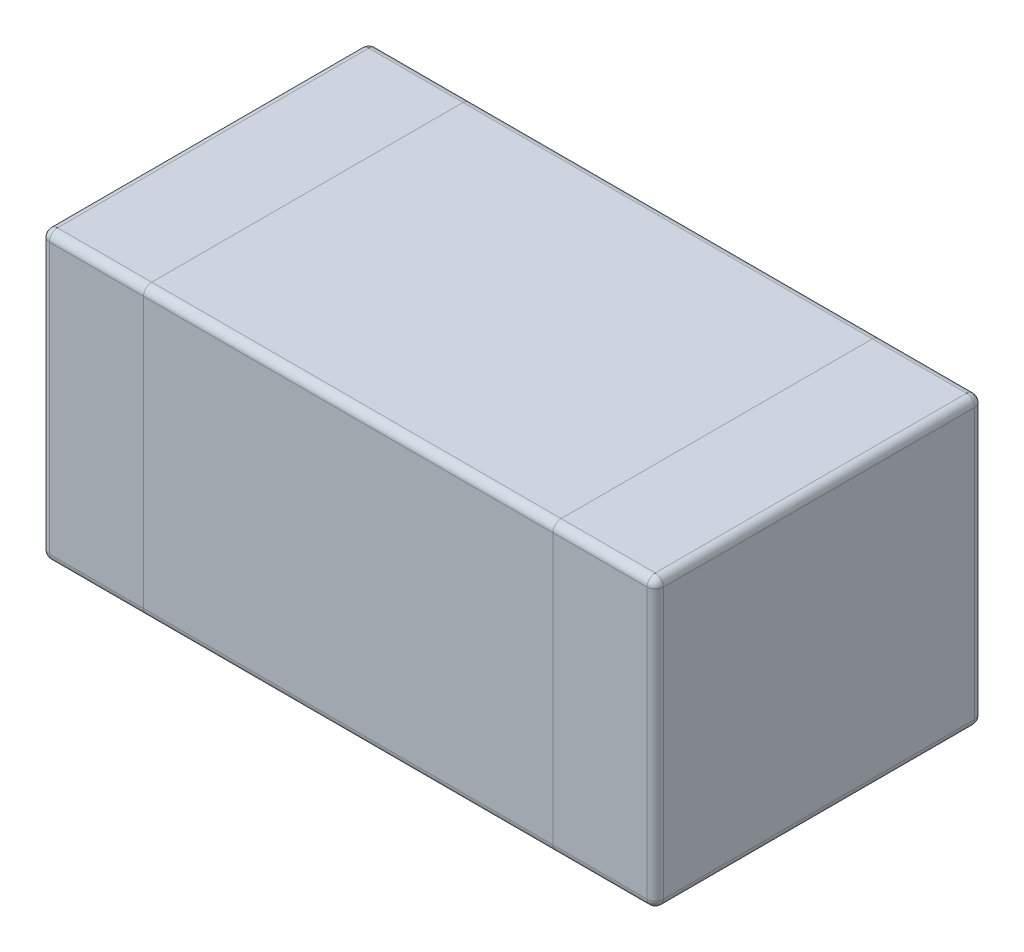
ISO-10303-21;
HEADER;
FILE_DESCRIPTION(('STEP AP214'),'2;1');
FILE_NAME('part.step','',(''),(''),'','','');
FILE_SCHEMA(('AUTOMOTIVE_DESIGN { 1 0 10303 214 1 1 1 1 }'));
ENDSEC;
DATA;
#1=APPLICATION_CONTEXT('core data for automotive mechanical design processes');
#2=APPLICATION_PROTOCOL_DEFINITION('international standard','automotive_design',2000,#1);
#3=PRODUCT_CONTEXT('',#1,'mechanical');
#4=PRODUCT('Part','Part','',(#3));
#5=PRODUCT_RELATED_PRODUCT_CATEGORY('part','',(#4));
#6=PRODUCT_DEFINITION_FORMATION('','',#4);
#7=PRODUCT_DEFINITION_CONTEXT('part definition',#1,'design');
#8=PRODUCT_DEFINITION('design','',#6,#7);
#9=PRODUCT_DEFINITION_SHAPE('','',#8);
#10=(LENGTH_UNIT() NAMED_UNIT(*) SI_UNIT(.MILLI.,.METRE.));
#11=(NAMED_UNIT(*) PLANE_ANGLE_UNIT() SI_UNIT($,.RADIAN.));
#12=(NAMED_UNIT(*) SI_UNIT($,.STERADIAN.) SOLID_ANGLE_UNIT());
#13=UNCERTAINTY_MEASURE_WITH_UNIT(LENGTH_MEASURE(1.E-05),#10,'distance_accuracy_value','');
#14=(GEOMETRIC_REPRESENTATION_CONTEXT(3) GLOBAL_UNCERTAINTY_ASSIGNED_CONTEXT((#13)) GLOBAL_UNIT_ASSIGNED_CONTEXT((#10,
#11,#12)) REPRESENTATION_CONTEXT('',''));
#15=CARTESIAN_POINT('',(0.,0.,0.));
#16=DIRECTION('',(0.,0.,1.));
#17=DIRECTION('',(1.,0.,0.));
#18=AXIS2_PLACEMENT_3D('',#15,#16,#17);
#19=CARTESIAN_POINT('',(-0.73,-0.35,0.38));
#20=DIRECTION('',(0.,1.,0.));
#21=DIRECTION('',(0.,0.,1.));
#22=AXIS2_PLACEMENT_3D('',#19,#20,#21);
#23=PLANE('',#22);
#24=DIRECTION('',(0.,0.,-1.));
#25=VECTOR('',#24,1.);
#26=CARTESIAN_POINT('',(-0.5,-0.35,0.38));
#27=LINE('',#26,#25);
#28=CARTESIAN_POINT('',(-0.5,-0.35,0.38));
#29=VERTEX_POINT('',#28);
#30=CARTESIAN_POINT('',(-0.5,-0.35,-0.38));
#31=VERTEX_POINT('',#30);
#32=EDGE_CURVE('E207',#29,#31,#27,.T.);
#33=ORIENTED_EDGE('',*,*,#32,.F.);
#34=DIRECTION('',(1.,0.,0.));
#35=VECTOR('',#34,1.);
#36=CARTESIAN_POINT('',(-0.73,-0.35,0.38));
#37=LINE('',#36,#35);
#38=CARTESIAN_POINT('',(-0.73,-0.35,0.38));
#39=VERTEX_POINT('',#38);
#40=EDGE_CURVE('E230',#29,#39,#37,.F.);
#41=ORIENTED_EDGE('',*,*,#40,.T.);
#42=DIRECTION('',(0.,0.,1.));
#43=VECTOR('',#42,1.);
#44=CARTESIAN_POINT('',(-0.73,-0.35,0.38));
#45=LINE('',#44,#43);
#46=CARTESIAN_POINT('',(-0.73,-0.35,-0.38));
#47=VERTEX_POINT('',#46);
#48=EDGE_CURVE('E228',#39,#47,#45,.F.);
#49=ORIENTED_EDGE('',*,*,#48,.T.);
#50=DIRECTION('',(-1.,0.,0.));
#51=VECTOR('',#50,1.);
#52=CARTESIAN_POINT('',(-0.73,-0.35,-0.38));
#53=LINE('',#52,#51);
#54=EDGE_CURVE('E226',#47,#31,#53,.F.);
#55=ORIENTED_EDGE('',*,*,#54,.T.);
#56=EDGE_LOOP('',(#33,#41,#49,#55));
#57=FACE_BOUND('',#56,.T.);
#58=ADVANCED_FACE('F36',(#57),#23,.F.);
#59=DIRECTION('',(0.,0.,-1.));
#60=VECTOR('',#59,1.);
#61=CARTESIAN_POINT('',(0.5,-0.35,0.38));
#62=LINE('',#61,#60);
#63=CARTESIAN_POINT('',(0.5,-0.35,0.38));
#64=VERTEX_POINT('',#63);
#65=CARTESIAN_POINT('',(0.5,-0.35,-0.38));
#66=VERTEX_POINT('',#65);
#67=EDGE_CURVE('E213',#64,#66,#62,.T.);
#68=ORIENTED_EDGE('',*,*,#67,.F.);
#69=DIRECTION('',(1.,0.,0.));
#70=VECTOR('',#69,1.);
#71=CARTESIAN_POINT('',(-0.73,-0.35,0.38));
#72=LINE('',#71,#70);
#73=EDGE_CURVE('E218',#64,#29,#72,.F.);
#74=ORIENTED_EDGE('',*,*,#73,.T.);
#75=ORIENTED_EDGE('',*,*,#32,.T.);
#76=DIRECTION('',(-1.,0.,0.));
#77=VECTOR('',#76,1.);
#78=CARTESIAN_POINT('',(-0.73,-0.35,-0.38));
#79=LINE('',#78,#77);
#80=EDGE_CURVE('E209',#31,#66,#79,.F.);
#81=ORIENTED_EDGE('',*,*,#80,.T.);
#82=EDGE_LOOP('',(#68,#74,#75,#81));
#83=FACE_BOUND('',#82,.T.);
#84=ADVANCED_FACE('F444',(#83),#23,.F.);
#85=CARTESIAN_POINT('',(-0.73,0.35,-0.4));
#86=DIRECTION('',(0.,0.,1.));
#87=DIRECTION('',(1.,0.,0.));
#88=AXIS2_PLACEMENT_3D('',#85,#86,#87);
#89=PLANE('',#88);
#90=DIRECTION('',(0.,-1.,0.));
#91=VECTOR('',#90,1.);
#92=CARTESIAN_POINT('',(0.5,0.35,-0.4));
#93=LINE('',#92,#91);
#94=CARTESIAN_POINT('',(0.5,0.33,-0.4));
#95=VERTEX_POINT('',#94);
#96=CARTESIAN_POINT('',(0.5,-0.33,-0.4));
#97=VERTEX_POINT('',#96);
#98=EDGE_CURVE('E193',#95,#97,#93,.T.);
#99=ORIENTED_EDGE('',*,*,#98,.T.);
#100=DIRECTION('',(-1.,0.,0.));
#101=VECTOR('',#100,1.);
#102=CARTESIAN_POINT('',(-0.73,-0.33,-0.4));
#103=LINE('',#102,#101);
#104=CARTESIAN_POINT('',(-0.5,-0.33,-0.4));
#105=VERTEX_POINT('',#104);
#106=EDGE_CURVE('E250',#97,#105,#103,.T.);
#107=ORIENTED_EDGE('',*,*,#106,.T.);
#108=DIRECTION('',(0.,-1.,0.));
#109=VECTOR('',#108,1.);
#110=CARTESIAN_POINT('',(-0.5,0.35,-0.4));
#111=LINE('',#110,#109);
#112=CARTESIAN_POINT('',(-0.5,0.33,-0.4));
#113=VERTEX_POINT('',#112);
#114=EDGE_CURVE('E400',#113,#105,#111,.T.);
#115=ORIENTED_EDGE('',*,*,#114,.F.);
#116=DIRECTION('',(-1.,0.,0.));
#117=VECTOR('',#116,1.);
#118=CARTESIAN_POINT('',(0.5,0.33,-0.4));
#119=LINE('',#118,#117);
#120=EDGE_CURVE('E248',#113,#95,#119,.F.);
#121=ORIENTED_EDGE('',*,*,#120,.T.);
#122=EDGE_LOOP('',(#99,#107,#115,#121));
#123=FACE_BOUND('',#122,.T.);
#124=ADVANCED_FACE('F505',(#123),#89,.F.);
#125=DIRECTION('',(0.,-1.,0.));
#126=VECTOR('',#125,1.);
#127=CARTESIAN_POINT('',(0.73,0.35,-0.4));
#128=LINE('',#127,#126);
#129=CARTESIAN_POINT('',(0.73,0.33,-0.4));
#130=VERTEX_POINT('',#129);
#131=CARTESIAN_POINT('',(0.73,-0.33,-0.4));
#132=VERTEX_POINT('',#131);
#133=EDGE_CURVE('E365',#130,#132,#128,.T.);
#134=ORIENTED_EDGE('',*,*,#133,.T.);
#135=DIRECTION('',(-1.,0.,0.));
#136=VECTOR('',#135,1.);
#137=CARTESIAN_POINT('',(-0.73,-0.33,-0.4));
#138=LINE('',#137,#136);
#139=EDGE_CURVE('E254',#132,#97,#138,.T.);
#140=ORIENTED_EDGE('',*,*,#139,.T.);
#141=ORIENTED_EDGE('',*,*,#98,.F.);
#142=DIRECTION('',(-1.,0.,0.));
#143=VECTOR('',#142,1.);
#144=CARTESIAN_POINT('',(0.73,0.33,-0.4));
#145=LINE('',#144,#143);
#146=EDGE_CURVE('E252',#95,#130,#145,.F.);
#147=ORIENTED_EDGE('',*,*,#146,.T.);
#148=EDGE_LOOP('',(#134,#140,#141,#147));
#149=FACE_BOUND('',#148,.T.);
#150=ADVANCED_FACE('F364',(#149),#89,.F.);
#151=CARTESIAN_POINT('',(-0.73,0.35,0.4));
#152=DIRECTION('',(0.,0.,-1.));
#153=DIRECTION('',(-1.,0.,0.));
#154=AXIS2_PLACEMENT_3D('',#151,#152,#153);
#155=PLANE('',#154);
#156=DIRECTION('',(0.,-1.,0.));
#157=VECTOR('',#156,1.);
#158=CARTESIAN_POINT('',(-0.5,0.35,0.4));
#159=LINE('',#158,#157);
#160=CARTESIAN_POINT('',(-0.5,0.33,0.4));
#161=VERTEX_POINT('',#160);
#162=CARTESIAN_POINT('',(-0.5,-0.33,0.4));
#163=VERTEX_POINT('',#162);
#164=EDGE_CURVE('E194',#161,#163,#159,.T.);
#165=ORIENTED_EDGE('',*,*,#164,.T.);
#166=DIRECTION('',(1.,0.,0.));
#167=VECTOR('',#166,1.);
#168=CARTESIAN_POINT('',(-0.73,-0.33,0.4));
#169=LINE('',#168,#167);
#170=CARTESIAN_POINT('',(0.5,-0.33,0.4));
#171=VERTEX_POINT('',#170);
#172=EDGE_CURVE('E191',#163,#171,#169,.T.);
#173=ORIENTED_EDGE('',*,*,#172,.T.);
#174=DIRECTION('',(0.,-1.,0.));
#175=VECTOR('',#174,1.);
#176=CARTESIAN_POINT('',(0.5,0.35,0.4));
#177=LINE('',#176,#175);
#178=CARTESIAN_POINT('',(0.5,0.33,0.4));
#179=VERTEX_POINT('',#178);
#180=EDGE_CURVE('E176',#179,#171,#177,.T.);
#181=ORIENTED_EDGE('',*,*,#180,.F.);
#182=DIRECTION('',(1.,0.,0.));
#183=VECTOR('',#182,1.);
#184=CARTESIAN_POINT('',(-0.5,0.33,0.4));
#185=LINE('',#184,#183);
#186=EDGE_CURVE('E188',#179,#161,#185,.F.);
#187=ORIENTED_EDGE('',*,*,#186,.T.);
#188=EDGE_LOOP('',(#165,#173,#181,#187));
#189=FACE_BOUND('',#188,.T.);
#190=ADVANCED_FACE('F186',(#189),#155,.F.);
#191=DIRECTION('',(0.,-1.,0.));
#192=VECTOR('',#191,1.);
#193=CARTESIAN_POINT('',(-0.73,0.35,0.4));
#194=LINE('',#193,#192);
#195=CARTESIAN_POINT('',(-0.73,0.33,0.4));
#196=VERTEX_POINT('',#195);
#197=CARTESIAN_POINT('',(-0.73,-0.33,0.4));
#198=VERTEX_POINT('',#197);
#199=EDGE_CURVE('E386',#196,#198,#194,.T.);
#200=ORIENTED_EDGE('',*,*,#199,.T.);
#201=DIRECTION('',(1.,0.,0.));
#202=VECTOR('',#201,1.);
#203=CARTESIAN_POINT('',(-0.73,-0.33,0.4));
#204=LINE('',#203,#202);
#205=EDGE_CURVE('E224',#198,#163,#204,.T.);
#206=ORIENTED_EDGE('',*,*,#205,.T.);
#207=ORIENTED_EDGE('',*,*,#164,.F.);
#208=DIRECTION('',(1.,0.,0.));
#209=VECTOR('',#208,1.);
#210=CARTESIAN_POINT('',(-0.73,0.33,0.4));
#211=LINE('',#210,#209);
#212=EDGE_CURVE('E221',#161,#196,#211,.F.);
#213=ORIENTED_EDGE('',*,*,#212,.T.);
#214=EDGE_LOOP('',(#200,#206,#207,#213));
#215=FACE_BOUND('',#214,.T.);
#216=ADVANCED_FACE('F480',(#215),#155,.F.);
#217=CARTESIAN_POINT('',(-0.73,0.35,0.38));
#218=DIRECTION('',(0.,1.,0.));
#219=DIRECTION('',(0.,0.,1.));
#220=AXIS2_PLACEMENT_3D('',#217,#218,#219);
#221=PLANE('',#220);
#222=DIRECTION('',(0.,0.,-1.));
#223=VECTOR('',#222,1.);
#224=CARTESIAN_POINT('',(0.73,0.35,-0.38));
#225=LINE('',#224,#223);
#226=CARTESIAN_POINT('',(0.73,0.35,0.38));
#227=VERTEX_POINT('',#226);
#228=CARTESIAN_POINT('',(0.73,0.35,-0.38));
#229=VERTEX_POINT('',#228);
#230=EDGE_CURVE('E53',#227,#229,#225,.T.);
#231=ORIENTED_EDGE('',*,*,#230,.T.);
#232=DIRECTION('',(-1.,0.,0.));
#233=VECTOR('',#232,1.);
#234=CARTESIAN_POINT('',(0.5,0.35,-0.38));
#235=LINE('',#234,#233);
#236=CARTESIAN_POINT('',(0.5,0.35,-0.38));
#237=VERTEX_POINT('',#236);
#238=EDGE_CURVE('E287',#229,#237,#235,.T.);
#239=ORIENTED_EDGE('',*,*,#238,.T.);
#240=DIRECTION('',(0.,0.,1.));
#241=VECTOR('',#240,1.);
#242=CARTESIAN_POINT('',(0.5,0.35,0.38));
#243=LINE('',#242,#241);
#244=CARTESIAN_POINT('',(0.5,0.35,0.38));
#245=VERTEX_POINT('',#244);
#246=EDGE_CURVE('E393',#237,#245,#243,.T.);
#247=ORIENTED_EDGE('',*,*,#246,.T.);
#248=DIRECTION('',(1.,0.,0.));
#249=VECTOR('',#248,1.);
#250=CARTESIAN_POINT('',(0.73,0.35,0.38));
#251=LINE('',#250,#249);
#252=EDGE_CURVE('E58',#245,#227,#251,.T.);
#253=ORIENTED_EDGE('',*,*,#252,.T.);
#254=EDGE_LOOP('',(#231,#239,#247,#253));
#255=FACE_BOUND('',#254,.T.);
#256=ADVANCED_FACE('F491',(#255),#221,.T.);
#257=ORIENTED_EDGE('',*,*,#246,.F.);
#258=DIRECTION('',(-1.,0.,0.));
#259=VECTOR('',#258,1.);
#260=CARTESIAN_POINT('',(-0.5,0.35,-0.38));
#261=LINE('',#260,#259);
#262=CARTESIAN_POINT('',(-0.5,0.35,-0.38));
#263=VERTEX_POINT('',#262);
#264=EDGE_CURVE('E283',#237,#263,#261,.T.);
#265=ORIENTED_EDGE('',*,*,#264,.T.);
#266=DIRECTION('',(0.,0.,1.));
#267=VECTOR('',#266,1.);
#268=CARTESIAN_POINT('',(-0.5,0.35,0.38));
#269=LINE('',#268,#267);
#270=CARTESIAN_POINT('',(-0.5,0.35,0.38));
#271=VERTEX_POINT('',#270);
#272=EDGE_CURVE('E389',#263,#271,#269,.T.);
#273=ORIENTED_EDGE('',*,*,#272,.T.);
#274=DIRECTION('',(1.,0.,0.));
#275=VECTOR('',#274,1.);
#276=CARTESIAN_POINT('',(0.5,0.35,0.38));
#277=LINE('',#276,#275);
#278=EDGE_CURVE('E281',#271,#245,#277,.T.);
#279=ORIENTED_EDGE('',*,*,#278,.T.);
#280=EDGE_LOOP('',(#257,#265,#273,#279));
#281=FACE_BOUND('',#280,.T.);
#282=ADVANCED_FACE('F490',(#281),#221,.T.);
#283=CARTESIAN_POINT('',(-0.73,0.35,0.38));
#284=DIRECTION('',(0.,-1.,0.));
#285=DIRECTION('',(0.,0.,-1.));
#286=AXIS2_PLACEMENT_3D('',#283,#284,#285);
#287=CYLINDRICAL_SURFACE('',#286,0.02);
#288=DIRECTION('',(0.,-1.,0.));
#289=VECTOR('',#288,1.);
#290=CARTESIAN_POINT('',(-0.75,0.35,0.38));
#291=LINE('',#290,#289);
#292=CARTESIAN_POINT('',(-0.75,0.33,0.38));
#293=VERTEX_POINT('',#292);
#294=CARTESIAN_POINT('',(-0.75,-0.33,0.38));
#295=VERTEX_POINT('',#294);
#296=EDGE_CURVE('E324',#293,#295,#291,.T.);
#297=ORIENTED_EDGE('',*,*,#296,.T.);
#298=CARTESIAN_POINT('',(-0.73,-0.33,0.38));
#299=DIRECTION('',(0.,-1.,0.));
#300=DIRECTION('',(0.,0.,-1.));
#301=AXIS2_PLACEMENT_3D('',#298,#299,#300);
#302=CIRCLE('',#301,0.02);
#303=EDGE_CURVE('E234',#295,#198,#302,.F.);
#304=ORIENTED_EDGE('',*,*,#303,.T.);
#305=ORIENTED_EDGE('',*,*,#199,.F.);
#306=CARTESIAN_POINT('',(-0.73,0.33,0.38));
#307=DIRECTION('',(0.,-1.,0.));
#308=DIRECTION('',(0.,0.,-1.));
#309=AXIS2_PLACEMENT_3D('',#306,#307,#308);
#310=CIRCLE('',#309,0.02);
#311=EDGE_CURVE('E232',#196,#293,#310,.T.);
#312=ORIENTED_EDGE('',*,*,#311,.T.);
#313=EDGE_LOOP('',(#297,#304,#305,#312));
#314=FACE_BOUND('',#313,.T.);
#315=ADVANCED_FACE('F469',(#314),#287,.T.);
#316=DIRECTION('',(0.,-1.,0.));
#317=VECTOR('',#316,1.);
#318=CARTESIAN_POINT('',(0.73,0.35,0.4));
#319=LINE('',#318,#317);
#320=CARTESIAN_POINT('',(0.73,0.33,0.4));
#321=VERTEX_POINT('',#320);
#322=CARTESIAN_POINT('',(0.73,-0.33,0.4));
#323=VERTEX_POINT('',#322);
#324=EDGE_CURVE('E178',#321,#323,#319,.T.);
#325=ORIENTED_EDGE('',*,*,#324,.F.);
#326=DIRECTION('',(1.,0.,0.));
#327=VECTOR('',#326,1.);
#328=CARTESIAN_POINT('',(0.5,0.33,0.4));
#329=LINE('',#328,#327);
#330=EDGE_CURVE('E11',#321,#179,#329,.F.);
#331=ORIENTED_EDGE('',*,*,#330,.T.);
#332=ORIENTED_EDGE('',*,*,#180,.T.);
#333=DIRECTION('',(1.,0.,0.));
#334=VECTOR('',#333,1.);
#335=CARTESIAN_POINT('',(-0.73,-0.33,0.4));
#336=LINE('',#335,#334);
#337=EDGE_CURVE('E45',#171,#323,#336,.T.);
#338=ORIENTED_EDGE('',*,*,#337,.T.);
#339=EDGE_LOOP('',(#325,#331,#332,#338));
#340=FACE_BOUND('',#339,.T.);
#341=ADVANCED_FACE('F175',(#340),#155,.F.);
#342=CARTESIAN_POINT('',(0.73,0.35,0.38));
#343=DIRECTION('',(0.,-1.,0.));
#344=DIRECTION('',(0.,0.,-1.));
#345=AXIS2_PLACEMENT_3D('',#342,#343,#344);
#346=CYLINDRICAL_SURFACE('',#345,0.0200000000000001);
#347=ORIENTED_EDGE('',*,*,#324,.T.);
#348=CARTESIAN_POINT('',(0.73,-0.33,0.38));
#349=DIRECTION('',(0.,-1.,0.));
#350=DIRECTION('',(0.,0.,-1.));
#351=AXIS2_PLACEMENT_3D('',#348,#349,#350);
#352=CIRCLE('',#351,0.0200000000000001);
#353=CARTESIAN_POINT('',(0.75,-0.33,0.38));
#354=VERTEX_POINT('',#353);
#355=EDGE_CURVE('E272',#323,#354,#352,.F.);
#356=ORIENTED_EDGE('',*,*,#355,.T.);
#357=DIRECTION('',(0.,-1.,0.));
#358=VECTOR('',#357,1.);
#359=CARTESIAN_POINT('',(0.75,0.35,0.38));
#360=LINE('',#359,#358);
#361=CARTESIAN_POINT('',(0.75,0.33,0.38));
#362=VERTEX_POINT('',#361);
#363=EDGE_CURVE('E376',#362,#354,#360,.T.);
#364=ORIENTED_EDGE('',*,*,#363,.F.);
#365=CARTESIAN_POINT('',(0.73,0.33,0.38));
#366=DIRECTION('',(0.,-1.,0.));
#367=DIRECTION('',(0.,0.,-1.));
#368=AXIS2_PLACEMENT_3D('',#365,#366,#367);
#369=CIRCLE('',#368,0.0200000000000001);
#370=EDGE_CURVE('E270',#362,#321,#369,.T.);
#371=ORIENTED_EDGE('',*,*,#370,.T.);
#372=EDGE_LOOP('',(#347,#356,#364,#371));
#373=FACE_BOUND('',#372,.T.);
#374=ADVANCED_FACE('F753',(#373),#346,.T.);
#375=CARTESIAN_POINT('',(0.75,0.35,0.38));
#376=DIRECTION('',(-1.,0.,0.));
#377=DIRECTION('',(0.,0.,1.));
#378=AXIS2_PLACEMENT_3D('',#375,#376,#377);
#379=PLANE('',#378);
#380=ORIENTED_EDGE('',*,*,#363,.T.);
#381=DIRECTION('',(0.,0.,-1.));
#382=VECTOR('',#381,1.);
#383=CARTESIAN_POINT('',(0.75,-0.33,0.38));
#384=LINE('',#383,#382);
#385=CARTESIAN_POINT('',(0.75,-0.33,-0.38));
#386=VERTEX_POINT('',#385);
#387=EDGE_CURVE('E268',#354,#386,#384,.T.);
#388=ORIENTED_EDGE('',*,*,#387,.T.);
#389=DIRECTION('',(0.,-1.,0.));
#390=VECTOR('',#389,1.);
#391=CARTESIAN_POINT('',(0.75,0.35,-0.38));
#392=LINE('',#391,#390);
#393=CARTESIAN_POINT('',(0.75,0.33,-0.38));
#394=VERTEX_POINT('',#393);
#395=EDGE_CURVE('E373',#394,#386,#392,.T.);
#396=ORIENTED_EDGE('',*,*,#395,.F.);
#397=DIRECTION('',(0.,0.,-1.));
#398=VECTOR('',#397,1.);
#399=CARTESIAN_POINT('',(0.75,0.33,0.38));
#400=LINE('',#399,#398);
#401=EDGE_CURVE('E266',#394,#362,#400,.F.);
#402=ORIENTED_EDGE('',*,*,#401,.T.);
#403=EDGE_LOOP('',(#380,#388,#396,#402));
#404=FACE_BOUND('',#403,.T.);
#405=ADVANCED_FACE('F744',(#404),#379,.F.);
#406=CARTESIAN_POINT('',(0.73,0.35,-0.38));
#407=DIRECTION('',(0.,-1.,0.));
#408=DIRECTION('',(0.,0.,-1.));
#409=AXIS2_PLACEMENT_3D('',#406,#407,#408);
#410=CYLINDRICAL_SURFACE('',#409,0.0200000000000001);
#411=ORIENTED_EDGE('',*,*,#395,.T.);
#412=CARTESIAN_POINT('',(0.73,-0.33,-0.38));
#413=DIRECTION('',(0.,-1.,0.));
#414=DIRECTION('',(0.,0.,-1.));
#415=AXIS2_PLACEMENT_3D('',#412,#413,#414);
#416=CIRCLE('',#415,0.0200000000000001);
#417=EDGE_CURVE('E264',#386,#132,#416,.F.);
#418=ORIENTED_EDGE('',*,*,#417,.T.);
#419=ORIENTED_EDGE('',*,*,#133,.F.);
#420=CARTESIAN_POINT('',(0.73,0.33,-0.38));
#421=DIRECTION('',(0.,-1.,0.));
#422=DIRECTION('',(0.,0.,-1.));
#423=AXIS2_PLACEMENT_3D('',#420,#421,#422);
#424=CIRCLE('',#423,0.0200000000000001);
#425=EDGE_CURVE('E262',#130,#394,#424,.T.);
#426=ORIENTED_EDGE('',*,*,#425,.T.);
#427=EDGE_LOOP('',(#411,#418,#419,#426));
#428=FACE_BOUND('',#427,.T.);
#429=ADVANCED_FACE('F370',(#428),#410,.T.);
#430=ORIENTED_EDGE('',*,*,#114,.T.);
#431=DIRECTION('',(-1.,0.,0.));
#432=VECTOR('',#431,1.);
#433=CARTESIAN_POINT('',(-0.73,-0.33,-0.4));
#434=LINE('',#433,#432);
#435=CARTESIAN_POINT('',(-0.73,-0.33,-0.4));
#436=VERTEX_POINT('',#435);
#437=EDGE_CURVE('E246',#105,#436,#434,.T.);
#438=ORIENTED_EDGE('',*,*,#437,.T.);
#439=DIRECTION('',(0.,-1.,0.));
#440=VECTOR('',#439,1.);
#441=CARTESIAN_POINT('',(-0.73,0.35,-0.4));
#442=LINE('',#441,#440);
#443=CARTESIAN_POINT('',(-0.73,0.33,-0.4));
#444=VERTEX_POINT('',#443);
#445=EDGE_CURVE('E374',#444,#436,#442,.T.);
#446=ORIENTED_EDGE('',*,*,#445,.F.);
#447=DIRECTION('',(-1.,0.,0.));
#448=VECTOR('',#447,1.);
#449=CARTESIAN_POINT('',(-0.5,0.33,-0.4));
#450=LINE('',#449,#448);
#451=EDGE_CURVE('E244',#444,#113,#450,.F.);
#452=ORIENTED_EDGE('',*,*,#451,.T.);
#453=EDGE_LOOP('',(#430,#438,#446,#452));
#454=FACE_BOUND('',#453,.T.);
#455=ADVANCED_FACE('F725',(#454),#89,.F.);
#456=CARTESIAN_POINT('',(-0.73,0.35,-0.38));
#457=DIRECTION('',(0.,-1.,0.));
#458=DIRECTION('',(0.,0.,-1.));
#459=AXIS2_PLACEMENT_3D('',#456,#457,#458);
#460=CYLINDRICAL_SURFACE('',#459,0.02);
#461=ORIENTED_EDGE('',*,*,#445,.T.);
#462=CARTESIAN_POINT('',(-0.73,-0.33,-0.38));
#463=DIRECTION('',(0.,-1.,0.));
#464=DIRECTION('',(0.,0.,-1.));
#465=AXIS2_PLACEMENT_3D('',#462,#463,#464);
#466=CIRCLE('',#465,0.02);
#467=CARTESIAN_POINT('',(-0.75,-0.33,-0.38));
#468=VERTEX_POINT('',#467);
#469=EDGE_CURVE('E242',#436,#468,#466,.F.);
#470=ORIENTED_EDGE('',*,*,#469,.T.);
#471=DIRECTION('',(0.,-1.,0.));
#472=VECTOR('',#471,1.);
#473=CARTESIAN_POINT('',(-0.75,0.35,-0.38));
#474=LINE('',#473,#472);
#475=CARTESIAN_POINT('',(-0.75,0.33,-0.38));
#476=VERTEX_POINT('',#475);
#477=EDGE_CURVE('E379',#476,#468,#474,.T.);
#478=ORIENTED_EDGE('',*,*,#477,.F.);
#479=CARTESIAN_POINT('',(-0.73,0.33,-0.38));
#480=DIRECTION('',(0.,-1.,0.));
#481=DIRECTION('',(0.,0.,-1.));
#482=AXIS2_PLACEMENT_3D('',#479,#480,#481);
#483=CIRCLE('',#482,0.02);
#484=EDGE_CURVE('E240',#476,#444,#483,.T.);
#485=ORIENTED_EDGE('',*,*,#484,.T.);
#486=EDGE_LOOP('',(#461,#470,#478,#485));
#487=FACE_BOUND('',#486,.T.);
#488=ADVANCED_FACE('F717',(#487),#460,.T.);
#489=CARTESIAN_POINT('',(-0.75,0.35,0.38));
#490=DIRECTION('',(1.,0.,0.));
#491=DIRECTION('',(0.,0.,-1.));
#492=AXIS2_PLACEMENT_3D('',#489,#490,#491);
#493=PLANE('',#492);
#494=ORIENTED_EDGE('',*,*,#477,.T.);
#495=DIRECTION('',(0.,0.,1.));
#496=VECTOR('',#495,1.);
#497=CARTESIAN_POINT('',(-0.75,-0.33,0.38));
#498=LINE('',#497,#496);
#499=EDGE_CURVE('E238',#468,#295,#498,.T.);
#500=ORIENTED_EDGE('',*,*,#499,.T.);
#501=ORIENTED_EDGE('',*,*,#296,.F.);
#502=DIRECTION('',(0.,0.,1.));
#503=VECTOR('',#502,1.);
#504=CARTESIAN_POINT('',(-0.75,0.33,-0.38));
#505=LINE('',#504,#503);
#506=EDGE_CURVE('E236',#293,#476,#505,.F.);
#507=ORIENTED_EDGE('',*,*,#506,.T.);
#508=EDGE_LOOP('',(#494,#500,#501,#507));
#509=FACE_BOUND('',#508,.T.);
#510=ADVANCED_FACE('F465',(#509),#493,.F.);
#511=DIRECTION('',(0.,0.,1.));
#512=VECTOR('',#511,1.);
#513=CARTESIAN_POINT('',(-0.73,0.35,0.38));
#514=LINE('',#513,#512);
#515=CARTESIAN_POINT('',(-0.73,0.35,-0.38));
#516=VERTEX_POINT('',#515);
#517=CARTESIAN_POINT('',(-0.73,0.35,0.38));
#518=VERTEX_POINT('',#517);
#519=EDGE_CURVE('E276',#516,#518,#514,.T.);
#520=ORIENTED_EDGE('',*,*,#519,.T.);
#521=DIRECTION('',(1.,0.,0.));
#522=VECTOR('',#521,1.);
#523=CARTESIAN_POINT('',(-0.5,0.35,0.38));
#524=LINE('',#523,#522);
#525=EDGE_CURVE('E278',#518,#271,#524,.T.);
#526=ORIENTED_EDGE('',*,*,#525,.T.);
#527=ORIENTED_EDGE('',*,*,#272,.F.);
#528=DIRECTION('',(-1.,0.,0.));
#529=VECTOR('',#528,1.);
#530=CARTESIAN_POINT('',(-0.73,0.35,-0.38));
#531=LINE('',#530,#529);
#532=EDGE_CURVE('E274',#263,#516,#531,.T.);
#533=ORIENTED_EDGE('',*,*,#532,.T.);
#534=EDGE_LOOP('',(#520,#526,#527,#533));
#535=FACE_BOUND('',#534,.T.);
#536=ADVANCED_FACE('F486',(#535),#221,.T.);
#537=ORIENTED_EDGE('',*,*,#67,.T.);
#538=DIRECTION('',(-1.,0.,0.));
#539=VECTOR('',#538,1.);
#540=CARTESIAN_POINT('',(-0.73,-0.35,-0.38));
#541=LINE('',#540,#539);
#542=CARTESIAN_POINT('',(0.73,-0.35,-0.38));
#543=VERTEX_POINT('',#542);
#544=EDGE_CURVE('E260',#66,#543,#541,.F.);
#545=ORIENTED_EDGE('',*,*,#544,.T.);
#546=DIRECTION('',(0.,0.,-1.));
#547=VECTOR('',#546,1.);
#548=CARTESIAN_POINT('',(0.73,-0.35,0.38));
#549=LINE('',#548,#547);
#550=CARTESIAN_POINT('',(0.73,-0.35,0.38));
#551=VERTEX_POINT('',#550);
#552=EDGE_CURVE('E258',#543,#551,#549,.F.);
#553=ORIENTED_EDGE('',*,*,#552,.T.);
#554=DIRECTION('',(1.,0.,0.));
#555=VECTOR('',#554,1.);
#556=CARTESIAN_POINT('',(-0.73,-0.35,0.38));
#557=LINE('',#556,#555);
#558=EDGE_CURVE('E256',#551,#64,#557,.F.);
#559=ORIENTED_EDGE('',*,*,#558,.T.);
#560=EDGE_LOOP('',(#537,#545,#553,#559));
#561=FACE_BOUND('',#560,.T.);
#562=ADVANCED_FACE('F410',(#561),#23,.F.);
#563=CARTESIAN_POINT('',(-0.73,-0.33,-0.38));
#564=DIRECTION('',(-1.,0.,0.));
#565=DIRECTION('',(0.,0.,1.));
#566=AXIS2_PLACEMENT_3D('',#563,#564,#565);
#567=CYLINDRICAL_SURFACE('',#566,0.02);
#568=CARTESIAN_POINT('',(0.5,-0.33,-0.38));
#569=DIRECTION('',(1.,0.,0.));
#570=DIRECTION('',(0.,0.,-1.));
#571=AXIS2_PLACEMENT_3D('',#568,#569,#570);
#572=CIRCLE('',#571,0.02);
#573=EDGE_CURVE('E318',#66,#97,#572,.T.);
#574=ORIENTED_EDGE('',*,*,#573,.F.);
#575=ORIENTED_EDGE('',*,*,#80,.F.);
#576=CARTESIAN_POINT('',(-0.5,-0.33,-0.38));
#577=DIRECTION('',(-1.,0.,0.));
#578=DIRECTION('',(0.,0.,1.));
#579=AXIS2_PLACEMENT_3D('',#576,#577,#578);
#580=CIRCLE('',#579,0.02);
#581=EDGE_CURVE('E321',#105,#31,#580,.T.);
#582=ORIENTED_EDGE('',*,*,#581,.F.);
#583=ORIENTED_EDGE('',*,*,#106,.F.);
#584=EDGE_LOOP('',(#574,#575,#582,#583));
#585=FACE_BOUND('',#584,.T.);
#586=ADVANCED_FACE('F419',(#585),#567,.T.);
#587=CARTESIAN_POINT('',(-0.73,-0.33,-0.38));
#588=DIRECTION('',(-1.,0.,0.));
#589=DIRECTION('',(0.,0.,1.));
#590=AXIS2_PLACEMENT_3D('',#587,#588,#589);
#591=CYLINDRICAL_SURFACE('',#590,0.02);
#592=ORIENTED_EDGE('',*,*,#581,.T.);
#593=ORIENTED_EDGE('',*,*,#54,.F.);
#594=CARTESIAN_POINT('',(-0.73,-0.33,-0.38));
#595=DIRECTION('',(-1.,0.,0.));
#596=DIRECTION('',(0.,0.,1.));
#597=AXIS2_PLACEMENT_3D('',#594,#595,#596);
#598=CIRCLE('',#597,0.02);
#599=EDGE_CURVE('E315',#436,#47,#598,.T.);
#600=ORIENTED_EDGE('',*,*,#599,.F.);
#601=ORIENTED_EDGE('',*,*,#437,.F.);
#602=EDGE_LOOP('',(#592,#593,#600,#601));
#603=FACE_BOUND('',#602,.T.);
#604=ADVANCED_FACE('F450',(#603),#591,.T.);
#605=CARTESIAN_POINT('',(-0.73,-0.33,-0.38));
#606=DIRECTION('',(-1.,0.,0.));
#607=DIRECTION('',(0.,0.,1.));
#608=AXIS2_PLACEMENT_3D('',#605,#606,#607);
#609=CYLINDRICAL_SURFACE('',#608,0.02);
#610=ORIENTED_EDGE('',*,*,#573,.T.);
#611=ORIENTED_EDGE('',*,*,#139,.F.);
#612=CARTESIAN_POINT('',(0.73,-0.33,-0.38));
#613=DIRECTION('',(1.,0.,0.));
#614=DIRECTION('',(0.,0.,-1.));
#615=AXIS2_PLACEMENT_3D('',#612,#613,#614);
#616=CIRCLE('',#615,0.02);
#617=EDGE_CURVE('E312',#543,#132,#616,.T.);
#618=ORIENTED_EDGE('',*,*,#617,.F.);
#619=ORIENTED_EDGE('',*,*,#544,.F.);
#620=EDGE_LOOP('',(#610,#611,#618,#619));
#621=FACE_BOUND('',#620,.T.);
#622=ADVANCED_FACE('F422',(#621),#609,.T.);
#623=CARTESIAN_POINT('',(-0.73,-0.33,-0.38));
#624=DIRECTION('',(0.,1.,0.));
#625=DIRECTION('',(0.,0.,1.));
#626=AXIS2_PLACEMENT_3D('',#623,#624,#625);
#627=SPHERICAL_SURFACE('',#626,0.02);
#628=ORIENTED_EDGE('',*,*,#469,.F.);
#629=ORIENTED_EDGE('',*,*,#599,.T.);
#630=CARTESIAN_POINT('',(-0.73,-0.33,-0.38));
#631=DIRECTION('',(0.,0.,1.));
#632=DIRECTION('',(1.,0.,0.));
#633=AXIS2_PLACEMENT_3D('',#630,#631,#632);
#634=CIRCLE('',#633,0.02);
#635=EDGE_CURVE('E309',#468,#47,#634,.T.);
#636=ORIENTED_EDGE('',*,*,#635,.F.);
#637=EDGE_LOOP('',(#628,#629,#636));
#638=FACE_BOUND('',#637,.T.);
#639=ADVANCED_FACE('F455',(#638),#627,.T.);
#640=CARTESIAN_POINT('',(0.73,-0.33,-0.38));
#641=DIRECTION('',(0.,1.,0.));
#642=DIRECTION('',(0.,0.,1.));
#643=AXIS2_PLACEMENT_3D('',#640,#641,#642);
#644=SPHERICAL_SURFACE('',#643,0.02);
#645=ORIENTED_EDGE('',*,*,#617,.T.);
#646=ORIENTED_EDGE('',*,*,#417,.F.);
#647=CARTESIAN_POINT('',(0.73,-0.33,-0.38));
#648=DIRECTION('',(0.,0.,1.));
#649=DIRECTION('',(1.,0.,0.));
#650=AXIS2_PLACEMENT_3D('',#647,#648,#649);
#651=CIRCLE('',#650,0.02);
#652=EDGE_CURVE('E306',#543,#386,#651,.T.);
#653=ORIENTED_EDGE('',*,*,#652,.F.);
#654=EDGE_LOOP('',(#645,#646,#653));
#655=FACE_BOUND('',#654,.T.);
#656=ADVANCED_FACE('F426',(#655),#644,.T.);
#657=CARTESIAN_POINT('',(-0.73,-0.33,0.38));
#658=DIRECTION('',(0.,0.,1.));
#659=DIRECTION('',(1.,0.,0.));
#660=AXIS2_PLACEMENT_3D('',#657,#658,#659);
#661=CYLINDRICAL_SURFACE('',#660,0.02);
#662=ORIENTED_EDGE('',*,*,#635,.T.);
#663=ORIENTED_EDGE('',*,*,#48,.F.);
#664=CARTESIAN_POINT('',(-0.73,-0.33,0.38));
#665=DIRECTION('',(0.,0.,1.));
#666=DIRECTION('',(1.,0.,0.));
#667=AXIS2_PLACEMENT_3D('',#664,#665,#666);
#668=CIRCLE('',#667,0.02);
#669=EDGE_CURVE('E303',#295,#39,#668,.T.);
#670=ORIENTED_EDGE('',*,*,#669,.F.);
#671=ORIENTED_EDGE('',*,*,#499,.F.);
#672=EDGE_LOOP('',(#662,#663,#670,#671));
#673=FACE_BOUND('',#672,.T.);
#674=ADVANCED_FACE('F458',(#673),#661,.T.);
#675=CARTESIAN_POINT('',(0.73,-0.33,0.38));
#676=DIRECTION('',(0.,0.,-1.));
#677=DIRECTION('',(-1.,0.,0.));
#678=AXIS2_PLACEMENT_3D('',#675,#676,#677);
#679=CYLINDRICAL_SURFACE('',#678,0.02);
#680=ORIENTED_EDGE('',*,*,#652,.T.);
#681=ORIENTED_EDGE('',*,*,#387,.F.);
#682=CARTESIAN_POINT('',(0.73,-0.33,0.38));
#683=DIRECTION('',(0.,0.,1.));
#684=DIRECTION('',(1.,0.,0.));
#685=AXIS2_PLACEMENT_3D('',#682,#683,#684);
#686=CIRCLE('',#685,0.02);
#687=EDGE_CURVE('E300',#551,#354,#686,.T.);
#688=ORIENTED_EDGE('',*,*,#687,.F.);
#689=ORIENTED_EDGE('',*,*,#552,.F.);
#690=EDGE_LOOP('',(#680,#681,#688,#689));
#691=FACE_BOUND('',#690,.T.);
#692=ADVANCED_FACE('F430',(#691),#679,.T.);
#693=CARTESIAN_POINT('',(-0.73,-0.33,0.38));
#694=DIRECTION('',(0.,1.,0.));
#695=DIRECTION('',(0.,0.,1.));
#696=AXIS2_PLACEMENT_3D('',#693,#694,#695);
#697=SPHERICAL_SURFACE('',#696,0.02);
#698=ORIENTED_EDGE('',*,*,#303,.F.);
#699=ORIENTED_EDGE('',*,*,#669,.T.);
#700=CARTESIAN_POINT('',(-0.73,-0.33,0.38));
#701=DIRECTION('',(1.,0.,0.));
#702=DIRECTION('',(0.,0.,-1.));
#703=AXIS2_PLACEMENT_3D('',#700,#701,#702);
#704=CIRCLE('',#703,0.02);
#705=EDGE_CURVE('E297',#198,#39,#704,.T.);
#706=ORIENTED_EDGE('',*,*,#705,.F.);
#707=EDGE_LOOP('',(#698,#699,#706));
#708=FACE_BOUND('',#707,.T.);
#709=ADVANCED_FACE('F568',(#708),#697,.T.);
#710=CARTESIAN_POINT('',(0.73,-0.33,0.38));
#711=DIRECTION('',(0.,1.,0.));
#712=DIRECTION('',(0.,0.,1.));
#713=AXIS2_PLACEMENT_3D('',#710,#711,#712);
#714=SPHERICAL_SURFACE('',#713,0.02);
#715=ORIENTED_EDGE('',*,*,#687,.T.);
#716=ORIENTED_EDGE('',*,*,#355,.F.);
#717=CARTESIAN_POINT('',(0.73,-0.33,0.38));
#718=DIRECTION('',(-1.,0.,0.));
#719=DIRECTION('',(0.,0.,1.));
#720=AXIS2_PLACEMENT_3D('',#717,#718,#719);
#721=CIRCLE('',#720,0.02);
#722=EDGE_CURVE('E294',#551,#323,#721,.T.);
#723=ORIENTED_EDGE('',*,*,#722,.F.);
#724=EDGE_LOOP('',(#715,#716,#723));
#725=FACE_BOUND('',#724,.T.);
#726=ADVANCED_FACE('F434',(#725),#714,.T.);
#727=CARTESIAN_POINT('',(-0.73,-0.33,0.38));
#728=DIRECTION('',(1.,0.,0.));
#729=DIRECTION('',(0.,0.,-1.));
#730=AXIS2_PLACEMENT_3D('',#727,#728,#729);
#731=CYLINDRICAL_SURFACE('',#730,0.02);
#732=ORIENTED_EDGE('',*,*,#705,.T.);
#733=ORIENTED_EDGE('',*,*,#40,.F.);
#734=CARTESIAN_POINT('',(-0.5,-0.33,0.38));
#735=DIRECTION('',(1.,0.,0.));
#736=DIRECTION('',(0.,0.,-1.));
#737=AXIS2_PLACEMENT_3D('',#734,#735,#736);
#738=CIRCLE('',#737,0.02);
#739=EDGE_CURVE('E292',#163,#29,#738,.T.);
#740=ORIENTED_EDGE('',*,*,#739,.F.);
#741=ORIENTED_EDGE('',*,*,#205,.F.);
#742=EDGE_LOOP('',(#732,#733,#740,#741));
#743=FACE_BOUND('',#742,.T.);
#744=ADVANCED_FACE('F559',(#743),#731,.T.);
#745=CARTESIAN_POINT('',(-0.73,-0.33,0.38));
#746=DIRECTION('',(1.,0.,0.));
#747=DIRECTION('',(0.,0.,-1.));
#748=AXIS2_PLACEMENT_3D('',#745,#746,#747);
#749=CYLINDRICAL_SURFACE('',#748,0.02);
#750=ORIENTED_EDGE('',*,*,#722,.T.);
#751=ORIENTED_EDGE('',*,*,#337,.F.);
#752=CARTESIAN_POINT('',(0.5,-0.33,0.38));
#753=DIRECTION('',(-1.,0.,0.));
#754=DIRECTION('',(0.,0.,1.));
#755=AXIS2_PLACEMENT_3D('',#752,#753,#754);
#756=CIRCLE('',#755,0.02);
#757=EDGE_CURVE('E290',#64,#171,#756,.T.);
#758=ORIENTED_EDGE('',*,*,#757,.F.);
#759=ORIENTED_EDGE('',*,*,#558,.F.);
#760=EDGE_LOOP('',(#750,#751,#758,#759));
#761=FACE_BOUND('',#760,.T.);
#762=ADVANCED_FACE('F438',(#761),#749,.T.);
#763=CARTESIAN_POINT('',(-0.73,-0.33,0.38));
#764=DIRECTION('',(1.,0.,0.));
#765=DIRECTION('',(0.,0.,-1.));
#766=AXIS2_PLACEMENT_3D('',#763,#764,#765);
#767=CYLINDRICAL_SURFACE('',#766,0.02);
#768=ORIENTED_EDGE('',*,*,#739,.T.);
#769=ORIENTED_EDGE('',*,*,#73,.F.);
#770=ORIENTED_EDGE('',*,*,#757,.T.);
#771=ORIENTED_EDGE('',*,*,#172,.F.);
#772=EDGE_LOOP('',(#768,#769,#770,#771));
#773=FACE_BOUND('',#772,.T.);
#774=ADVANCED_FACE('F440',(#773),#767,.T.);
#775=CARTESIAN_POINT('',(-0.73,0.33,-0.38));
#776=DIRECTION('',(1.,0.,0.));
#777=DIRECTION('',(0.,0.,-1.));
#778=AXIS2_PLACEMENT_3D('',#775,#776,#777);
#779=CYLINDRICAL_SURFACE('',#778,0.02);
#780=CARTESIAN_POINT('',(0.73,0.33,-0.38));
#781=DIRECTION('',(1.,0.,0.));
#782=DIRECTION('',(0.,0.,-1.));
#783=AXIS2_PLACEMENT_3D('',#780,#781,#782);
#784=CIRCLE('',#783,0.02);
#785=EDGE_CURVE('E345',#130,#229,#784,.T.);
#786=ORIENTED_EDGE('',*,*,#785,.F.);
#787=ORIENTED_EDGE('',*,*,#146,.F.);
#788=CARTESIAN_POINT('',(0.5,0.33,-0.38));
#789=DIRECTION('',(-1.,0.,0.));
#790=DIRECTION('',(0.,0.,1.));
#791=AXIS2_PLACEMENT_3D('',#788,#789,#790);
#792=CIRCLE('',#791,0.02);
#793=EDGE_CURVE('E40',#237,#95,#792,.T.);
#794=ORIENTED_EDGE('',*,*,#793,.F.);
#795=ORIENTED_EDGE('',*,*,#238,.F.);
#796=EDGE_LOOP('',(#786,#787,#794,#795));
#797=FACE_BOUND('',#796,.T.);
#798=ADVANCED_FACE('F38',(#797),#779,.T.);
#799=CARTESIAN_POINT('',(-0.73,0.33,-0.38));
#800=DIRECTION('',(1.,0.,0.));
#801=DIRECTION('',(0.,0.,-1.));
#802=AXIS2_PLACEMENT_3D('',#799,#800,#801);
#803=CYLINDRICAL_SURFACE('',#802,0.02);
#804=ORIENTED_EDGE('',*,*,#793,.T.);
#805=ORIENTED_EDGE('',*,*,#120,.F.);
#806=CARTESIAN_POINT('',(-0.5,0.33,-0.38));
#807=DIRECTION('',(-1.,0.,0.));
#808=DIRECTION('',(0.,0.,1.));
#809=AXIS2_PLACEMENT_3D('',#806,#807,#808);
#810=CIRCLE('',#809,0.02);
#811=EDGE_CURVE('E343',#263,#113,#810,.T.);
#812=ORIENTED_EDGE('',*,*,#811,.F.);
#813=ORIENTED_EDGE('',*,*,#264,.F.);
#814=EDGE_LOOP('',(#804,#805,#812,#813));
#815=FACE_BOUND('',#814,.T.);
#816=ADVANCED_FACE('F356',(#815),#803,.T.);
#817=CARTESIAN_POINT('',(0.73,0.33,-0.38));
#818=DIRECTION('',(0.,1.,0.));
#819=DIRECTION('',(0.,0.,1.));
#820=AXIS2_PLACEMENT_3D('',#817,#818,#819);
#821=SPHERICAL_SURFACE('',#820,0.02);
#822=ORIENTED_EDGE('',*,*,#425,.F.);
#823=ORIENTED_EDGE('',*,*,#785,.T.);
#824=CARTESIAN_POINT('',(0.73,0.33,-0.38));
#825=DIRECTION('',(0.,0.,1.));
#826=DIRECTION('',(1.,0.,0.));
#827=AXIS2_PLACEMENT_3D('',#824,#825,#826);
#828=CIRCLE('',#827,0.02);
#829=EDGE_CURVE('E340',#394,#229,#828,.T.);
#830=ORIENTED_EDGE('',*,*,#829,.F.);
#831=EDGE_LOOP('',(#822,#823,#830));
#832=FACE_BOUND('',#831,.T.);
#833=ADVANCED_FACE('F545',(#832),#821,.T.);
#834=CARTESIAN_POINT('',(-0.73,0.33,-0.38));
#835=DIRECTION('',(1.,0.,0.));
#836=DIRECTION('',(0.,0.,-1.));
#837=AXIS2_PLACEMENT_3D('',#834,#835,#836);
#838=CYLINDRICAL_SURFACE('',#837,0.02);
#839=ORIENTED_EDGE('',*,*,#811,.T.);
#840=ORIENTED_EDGE('',*,*,#451,.F.);
#841=CARTESIAN_POINT('',(-0.73,0.33,-0.38));
#842=DIRECTION('',(-1.,0.,0.));
#843=DIRECTION('',(0.,0.,1.));
#844=AXIS2_PLACEMENT_3D('',#841,#842,#843);
#845=CIRCLE('',#844,0.02);
#846=EDGE_CURVE('E337',#516,#444,#845,.T.);
#847=ORIENTED_EDGE('',*,*,#846,.F.);
#848=ORIENTED_EDGE('',*,*,#532,.F.);
#849=EDGE_LOOP('',(#839,#840,#847,#848));
#850=FACE_BOUND('',#849,.T.);
#851=ADVANCED_FACE('F541',(#850),#838,.T.);
#852=CARTESIAN_POINT('',(0.73,0.33,0.38));
#853=DIRECTION('',(0.,0.,1.));
#854=DIRECTION('',(1.,0.,0.));
#855=AXIS2_PLACEMENT_3D('',#852,#853,#854);
#856=CYLINDRICAL_SURFACE('',#855,0.02);
#857=ORIENTED_EDGE('',*,*,#829,.T.);
#858=ORIENTED_EDGE('',*,*,#230,.F.);
#859=CARTESIAN_POINT('',(0.73,0.33,0.38));
#860=DIRECTION('',(0.,0.,1.));
#861=DIRECTION('',(1.,0.,0.));
#862=AXIS2_PLACEMENT_3D('',#859,#860,#861);
#863=CIRCLE('',#862,0.02);
#864=EDGE_CURVE('E334',#362,#227,#863,.T.);
#865=ORIENTED_EDGE('',*,*,#864,.F.);
#866=ORIENTED_EDGE('',*,*,#401,.F.);
#867=EDGE_LOOP('',(#857,#858,#865,#866));
#868=FACE_BOUND('',#867,.T.);
#869=ADVANCED_FACE('F537',(#868),#856,.T.);
#870=CARTESIAN_POINT('',(-0.73,0.33,-0.38));
#871=DIRECTION('',(0.,1.,0.));
#872=DIRECTION('',(0.,0.,1.));
#873=AXIS2_PLACEMENT_3D('',#870,#871,#872);
#874=SPHERICAL_SURFACE('',#873,0.02);
#875=ORIENTED_EDGE('',*,*,#846,.T.);
#876=ORIENTED_EDGE('',*,*,#484,.F.);
#877=CARTESIAN_POINT('',(-0.73,0.33,-0.38));
#878=DIRECTION('',(0.,0.,1.));
#879=DIRECTION('',(1.,0.,0.));
#880=AXIS2_PLACEMENT_3D('',#877,#878,#879);
#881=CIRCLE('',#880,0.02);
#882=EDGE_CURVE('E331',#516,#476,#881,.T.);
#883=ORIENTED_EDGE('',*,*,#882,.F.);
#884=EDGE_LOOP('',(#875,#876,#883));
#885=FACE_BOUND('',#884,.T.);
#886=ADVANCED_FACE('F533',(#885),#874,.T.);
#887=CARTESIAN_POINT('',(0.73,0.33,0.38));
#888=DIRECTION('',(0.,1.,0.));
#889=DIRECTION('',(0.,0.,1.));
#890=AXIS2_PLACEMENT_3D('',#887,#888,#889);
#891=SPHERICAL_SURFACE('',#890,0.02);
#892=ORIENTED_EDGE('',*,*,#370,.F.);
#893=ORIENTED_EDGE('',*,*,#864,.T.);
#894=CARTESIAN_POINT('',(0.73,0.33,0.38));
#895=DIRECTION('',(-1.,0.,0.));
#896=DIRECTION('',(0.,0.,1.));
#897=AXIS2_PLACEMENT_3D('',#894,#895,#896);
#898=CIRCLE('',#897,0.02);
#899=EDGE_CURVE('E329',#321,#227,#898,.T.);
#900=ORIENTED_EDGE('',*,*,#899,.F.);
#901=EDGE_LOOP('',(#892,#893,#900));
#902=FACE_BOUND('',#901,.T.);
#903=ADVANCED_FACE('F529',(#902),#891,.T.);
#904=CARTESIAN_POINT('',(-0.73,0.33,0.38));
#905=DIRECTION('',(0.,0.,-1.));
#906=DIRECTION('',(-1.,0.,0.));
#907=AXIS2_PLACEMENT_3D('',#904,#905,#906);
#908=CYLINDRICAL_SURFACE('',#907,0.02);
#909=ORIENTED_EDGE('',*,*,#882,.T.);
#910=ORIENTED_EDGE('',*,*,#506,.F.);
#911=CARTESIAN_POINT('',(-0.73,0.33,0.38));
#912=DIRECTION('',(0.,0.,1.));
#913=DIRECTION('',(1.,0.,0.));
#914=AXIS2_PLACEMENT_3D('',#911,#912,#913);
#915=CIRCLE('',#914,0.02);
#916=EDGE_CURVE('E201',#518,#293,#915,.T.);
#917=ORIENTED_EDGE('',*,*,#916,.F.);
#918=ORIENTED_EDGE('',*,*,#519,.F.);
#919=EDGE_LOOP('',(#909,#910,#917,#918));
#920=FACE_BOUND('',#919,.T.);
#921=ADVANCED_FACE('F526',(#920),#908,.T.);
#922=CARTESIAN_POINT('',(-0.73,0.33,0.38));
#923=DIRECTION('',(-1.,0.,0.));
#924=DIRECTION('',(0.,0.,1.));
#925=AXIS2_PLACEMENT_3D('',#922,#923,#924);
#926=CYLINDRICAL_SURFACE('',#925,0.02);
#927=ORIENTED_EDGE('',*,*,#899,.T.);
#928=ORIENTED_EDGE('',*,*,#252,.F.);
#929=CARTESIAN_POINT('',(0.5,0.33,0.38));
#930=DIRECTION('',(-1.,0.,0.));
#931=DIRECTION('',(0.,0.,1.));
#932=AXIS2_PLACEMENT_3D('',#929,#930,#931);
#933=CIRCLE('',#932,0.02);
#934=EDGE_CURVE('E197',#179,#245,#933,.T.);
#935=ORIENTED_EDGE('',*,*,#934,.F.);
#936=ORIENTED_EDGE('',*,*,#330,.F.);
#937=EDGE_LOOP('',(#927,#928,#935,#936));
#938=FACE_BOUND('',#937,.T.);
#939=ADVANCED_FACE('F198',(#938),#926,.T.);
#940=CARTESIAN_POINT('',(-0.73,0.33,0.38));
#941=DIRECTION('',(0.,1.,0.));
#942=DIRECTION('',(0.,0.,1.));
#943=AXIS2_PLACEMENT_3D('',#940,#941,#942);
#944=SPHERICAL_SURFACE('',#943,0.02);
#945=ORIENTED_EDGE('',*,*,#916,.T.);
#946=ORIENTED_EDGE('',*,*,#311,.F.);
#947=CARTESIAN_POINT('',(-0.73,0.33,0.38));
#948=DIRECTION('',(1.,0.,0.));
#949=DIRECTION('',(0.,0.,-1.));
#950=AXIS2_PLACEMENT_3D('',#947,#948,#949);
#951=CIRCLE('',#950,0.02);
#952=EDGE_CURVE('E202',#518,#196,#951,.T.);
#953=ORIENTED_EDGE('',*,*,#952,.F.);
#954=EDGE_LOOP('',(#945,#946,#953));
#955=FACE_BOUND('',#954,.T.);
#956=ADVANCED_FACE('F475',(#955),#944,.T.);
#957=CARTESIAN_POINT('',(-0.73,0.33,0.38));
#958=DIRECTION('',(-1.,0.,0.));
#959=DIRECTION('',(0.,0.,1.));
#960=AXIS2_PLACEMENT_3D('',#957,#958,#959);
#961=CYLINDRICAL_SURFACE('',#960,0.02);
#962=ORIENTED_EDGE('',*,*,#934,.T.);
#963=ORIENTED_EDGE('',*,*,#278,.F.);
#964=CARTESIAN_POINT('',(-0.5,0.33,0.38));
#965=DIRECTION('',(-1.,0.,0.));
#966=DIRECTION('',(0.,0.,1.));
#967=AXIS2_PLACEMENT_3D('',#964,#965,#966);
#968=CIRCLE('',#967,0.02);
#969=EDGE_CURVE('E206',#161,#271,#968,.T.);
#970=ORIENTED_EDGE('',*,*,#969,.F.);
#971=ORIENTED_EDGE('',*,*,#186,.F.);
#972=EDGE_LOOP('',(#962,#963,#970,#971));
#973=FACE_BOUND('',#972,.T.);
#974=ADVANCED_FACE('F205',(#973),#961,.T.);
#975=CARTESIAN_POINT('',(-0.73,0.33,0.38));
#976=DIRECTION('',(-1.,0.,0.));
#977=DIRECTION('',(0.,0.,1.));
#978=AXIS2_PLACEMENT_3D('',#975,#976,#977);
#979=CYLINDRICAL_SURFACE('',#978,0.02);
#980=ORIENTED_EDGE('',*,*,#952,.T.);
#981=ORIENTED_EDGE('',*,*,#212,.F.);
#982=ORIENTED_EDGE('',*,*,#969,.T.);
#983=ORIENTED_EDGE('',*,*,#525,.F.);
#984=EDGE_LOOP('',(#980,#981,#982,#983));
#985=FACE_BOUND('',#984,.T.);
#986=ADVANCED_FACE('F483',(#985),#979,.T.);
#987=CLOSED_SHELL('',(#58,#84,#124,#150,#190,#216,#256,#282,#315,#341,#374,#405,#429,#455,#488,
#510,#536,#562,#586,#604,#622,#639,#656,#674,#692,#709,#726,#744,#762,#774,#798,#816,#833,#851,
#869,#886,#903,#921,#939,#956,#974,#986));
#988=MANIFOLD_SOLID_BREP('B2',#987);
#989=ADVANCED_BREP_SHAPE_REPRESENTATION('',(#18,#988),#14);
#990=SHAPE_DEFINITION_REPRESENTATION(#9,#989);
ENDSEC;
END-ISO-10303-21;
